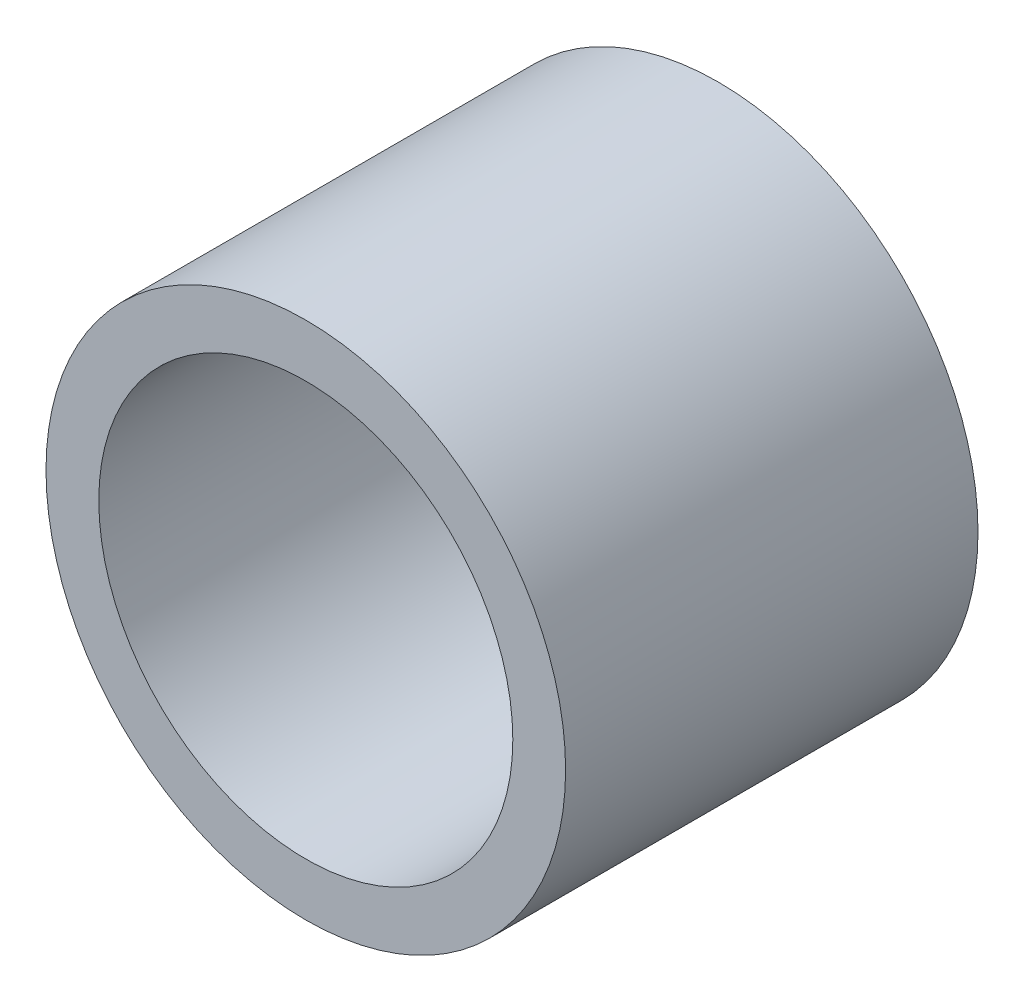
ISO-10303-21;
HEADER;
FILE_DESCRIPTION(('STEP AP214'),'2;1');
FILE_NAME('part.step','',(''),(''),'','','');
FILE_SCHEMA(('AUTOMOTIVE_DESIGN { 1 0 10303 214 1 1 1 1 }'));
ENDSEC;
DATA;
#1=APPLICATION_CONTEXT('core data for automotive mechanical design processes');
#2=APPLICATION_PROTOCOL_DEFINITION('international standard','automotive_design',2000,#1);
#3=PRODUCT_CONTEXT('',#1,'mechanical');
#4=PRODUCT('Part','Part','',(#3));
#5=PRODUCT_RELATED_PRODUCT_CATEGORY('part','',(#4));
#6=PRODUCT_DEFINITION_FORMATION('','',#4);
#7=PRODUCT_DEFINITION_CONTEXT('part definition',#1,'design');
#8=PRODUCT_DEFINITION('design','',#6,#7);
#9=PRODUCT_DEFINITION_SHAPE('','',#8);
#10=(LENGTH_UNIT() NAMED_UNIT(*) SI_UNIT(.MILLI.,.METRE.));
#11=(NAMED_UNIT(*) PLANE_ANGLE_UNIT() SI_UNIT($,.RADIAN.));
#12=(NAMED_UNIT(*) SI_UNIT($,.STERADIAN.) SOLID_ANGLE_UNIT());
#13=UNCERTAINTY_MEASURE_WITH_UNIT(LENGTH_MEASURE(1.E-05),#10,'distance_accuracy_value','');
#14=(GEOMETRIC_REPRESENTATION_CONTEXT(3) GLOBAL_UNCERTAINTY_ASSIGNED_CONTEXT((#13)) GLOBAL_UNIT_ASSIGNED_CONTEXT((#10,
#11,#12)) REPRESENTATION_CONTEXT('',''));
#15=CARTESIAN_POINT('',(0.,0.,0.));
#16=DIRECTION('',(0.,0.,1.));
#17=DIRECTION('',(1.,0.,0.));
#18=AXIS2_PLACEMENT_3D('',#15,#16,#17);
#19=CARTESIAN_POINT('',(0.,0.,3.175));
#20=DIRECTION('',(0.,0.,1.));
#21=DIRECTION('',(1.,0.,0.));
#22=AXIS2_PLACEMENT_3D('',#19,#20,#21);
#23=PLANE('',#22);
#24=CARTESIAN_POINT('',(0.,0.,3.175));
#25=DIRECTION('',(0.,0.,1.));
#26=DIRECTION('',(1.,0.,0.));
#27=AXIS2_PLACEMENT_3D('',#24,#25,#26);
#28=CIRCLE('',#27,4.0005);
#29=CARTESIAN_POINT('',(4.0005,0.,3.175));
#30=VERTEX_POINT('',#29);
#31=EDGE_CURVE('E10',#30,#30,#28,.T.);
#32=ORIENTED_EDGE('',*,*,#31,.T.);
#33=EDGE_LOOP('',(#32));
#34=FACE_BOUND('',#33,.T.);
#35=CARTESIAN_POINT('',(0.,0.,3.175));
#36=DIRECTION('',(0.,0.,1.));
#37=DIRECTION('',(1.,0.,0.));
#38=AXIS2_PLACEMENT_3D('',#35,#36,#37);
#39=CIRCLE('',#38,3.1877);
#40=CARTESIAN_POINT('',(3.1877,0.,3.175));
#41=VERTEX_POINT('',#40);
#42=EDGE_CURVE('E41',#41,#41,#39,.T.);
#43=ORIENTED_EDGE('',*,*,#42,.F.);
#44=EDGE_LOOP('',(#43));
#45=FACE_BOUND('',#44,.T.);
#46=ADVANCED_FACE('F30',(#34,#45),#23,.T.);
#47=CARTESIAN_POINT('',(0.,0.,-3.175));
#48=DIRECTION('',(0.,0.,1.));
#49=DIRECTION('',(1.,0.,0.));
#50=AXIS2_PLACEMENT_3D('',#47,#48,#49);
#51=PLANE('',#50);
#52=CARTESIAN_POINT('',(0.,0.,-3.175));
#53=DIRECTION('',(0.,0.,1.));
#54=DIRECTION('',(1.,0.,0.));
#55=AXIS2_PLACEMENT_3D('',#52,#53,#54);
#56=CIRCLE('',#55,4.0005);
#57=CARTESIAN_POINT('',(4.0005,0.,-3.175));
#58=VERTEX_POINT('',#57);
#59=EDGE_CURVE('E34',#58,#58,#56,.T.);
#60=ORIENTED_EDGE('',*,*,#59,.F.);
#61=EDGE_LOOP('',(#60));
#62=FACE_BOUND('',#61,.T.);
#63=CARTESIAN_POINT('',(0.,0.,-3.175));
#64=DIRECTION('',(0.,0.,1.));
#65=DIRECTION('',(1.,0.,0.));
#66=AXIS2_PLACEMENT_3D('',#63,#64,#65);
#67=CIRCLE('',#66,3.1877);
#68=CARTESIAN_POINT('',(3.1877,0.,-3.175));
#69=VERTEX_POINT('',#68);
#70=EDGE_CURVE('E43',#69,#69,#67,.T.);
#71=ORIENTED_EDGE('',*,*,#70,.T.);
#72=EDGE_LOOP('',(#71));
#73=FACE_BOUND('',#72,.T.);
#74=ADVANCED_FACE('F53',(#62,#73),#51,.F.);
#75=CARTESIAN_POINT('',(0.,0.,3.175));
#76=DIRECTION('',(0.,0.,-1.));
#77=DIRECTION('',(-1.,0.,0.));
#78=AXIS2_PLACEMENT_3D('',#75,#76,#77);
#79=CYLINDRICAL_SURFACE('',#78,4.0005);
#80=ORIENTED_EDGE('',*,*,#31,.F.);
#81=EDGE_LOOP('',(#80));
#82=FACE_BOUND('',#81,.T.);
#83=ORIENTED_EDGE('',*,*,#59,.T.);
#84=EDGE_LOOP('',(#83));
#85=FACE_BOUND('',#84,.T.);
#86=ADVANCED_FACE('F32',(#82,#85),#79,.T.);
#87=CARTESIAN_POINT('',(0.,0.,3.175));
#88=DIRECTION('',(0.,0.,-1.));
#89=DIRECTION('',(-1.,0.,0.));
#90=AXIS2_PLACEMENT_3D('',#87,#88,#89);
#91=CYLINDRICAL_SURFACE('',#90,3.1877);
#92=ORIENTED_EDGE('',*,*,#42,.T.);
#93=EDGE_LOOP('',(#92));
#94=FACE_BOUND('',#93,.T.);
#95=ORIENTED_EDGE('',*,*,#70,.F.);
#96=EDGE_LOOP('',(#95));
#97=FACE_BOUND('',#96,.T.);
#98=ADVANCED_FACE('F49',(#94,#97),#91,.F.);
#99=CLOSED_SHELL('',(#46,#74,#86,#98));
#100=MANIFOLD_SOLID_BREP('B2',#99);
#101=ADVANCED_BREP_SHAPE_REPRESENTATION('',(#18,#100),#14);
#102=SHAPE_DEFINITION_REPRESENTATION(#9,#101);
ENDSEC;
END-ISO-10303-21;
